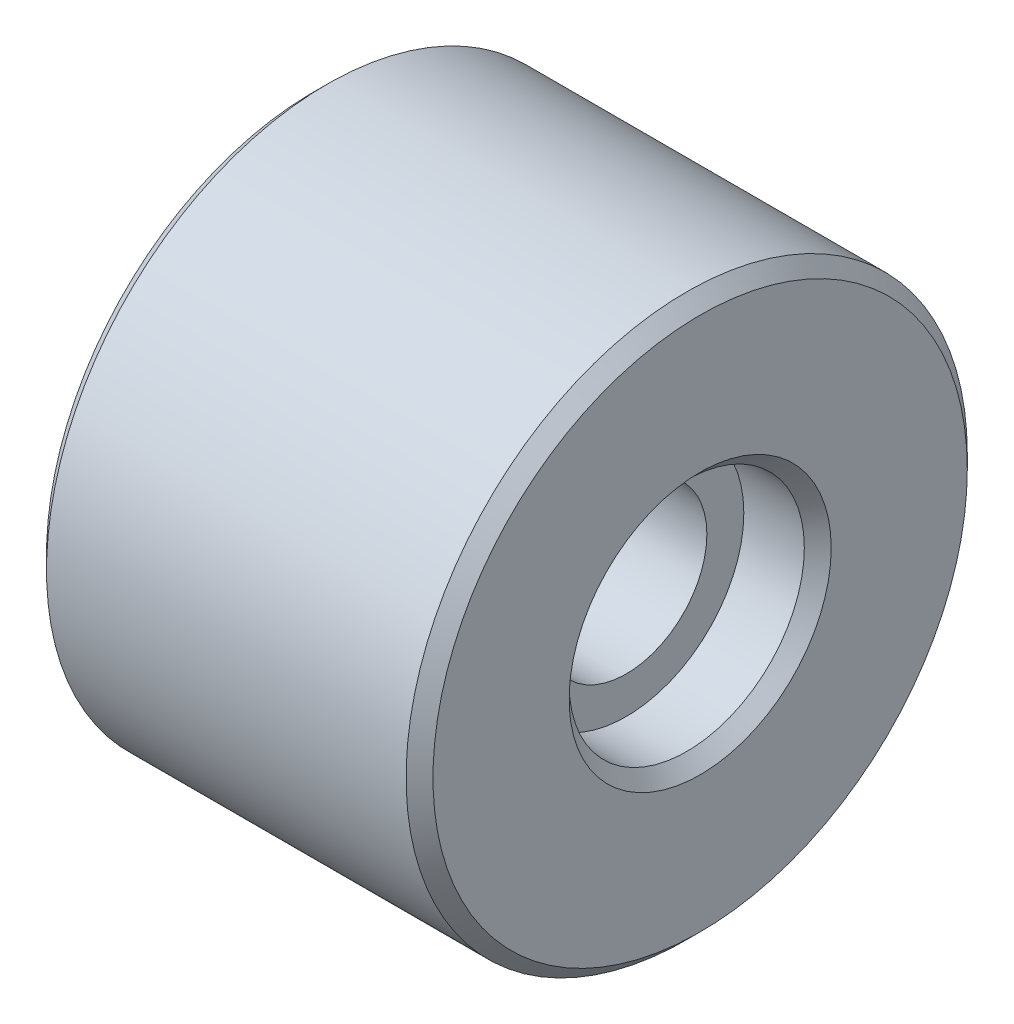
ISO-10303-21;
HEADER;
FILE_DESCRIPTION(('STEP AP214'),'2;1');
FILE_NAME('part.step','',(''),(''),'','','');
FILE_SCHEMA(('AUTOMOTIVE_DESIGN { 1 0 10303 214 1 1 1 1 }'));
ENDSEC;
DATA;
#1=APPLICATION_CONTEXT('core data for automotive mechanical design processes');
#2=APPLICATION_PROTOCOL_DEFINITION('international standard','automotive_design',2000,#1);
#3=PRODUCT_CONTEXT('',#1,'mechanical');
#4=PRODUCT('Part','Part','',(#3));
#5=PRODUCT_RELATED_PRODUCT_CATEGORY('part','',(#4));
#6=PRODUCT_DEFINITION_FORMATION('','',#4);
#7=PRODUCT_DEFINITION_CONTEXT('part definition',#1,'design');
#8=PRODUCT_DEFINITION('design','',#6,#7);
#9=PRODUCT_DEFINITION_SHAPE('','',#8);
#10=(LENGTH_UNIT() NAMED_UNIT(*) SI_UNIT(.MILLI.,.METRE.));
#11=(NAMED_UNIT(*) PLANE_ANGLE_UNIT() SI_UNIT($,.RADIAN.));
#12=(NAMED_UNIT(*) SI_UNIT($,.STERADIAN.) SOLID_ANGLE_UNIT());
#13=UNCERTAINTY_MEASURE_WITH_UNIT(LENGTH_MEASURE(1.E-05),#10,'distance_accuracy_value','');
#14=(GEOMETRIC_REPRESENTATION_CONTEXT(3) GLOBAL_UNCERTAINTY_ASSIGNED_CONTEXT((#13)) GLOBAL_UNIT_ASSIGNED_CONTEXT((#10,
#11,#12)) REPRESENTATION_CONTEXT('',''));
#15=CARTESIAN_POINT('',(0.,0.,0.));
#16=DIRECTION('',(0.,0.,1.));
#17=DIRECTION('',(1.,0.,0.));
#18=AXIS2_PLACEMENT_3D('',#15,#16,#17);
#19=CARTESIAN_POINT('',(11.5,0.,0.));
#20=DIRECTION('',(-1.,0.,0.));
#21=DIRECTION('',(0.,0.,1.));
#22=AXIS2_PLACEMENT_3D('',#19,#20,#21);
#23=CYLINDRICAL_SURFACE('',#22,2.4);
#24=CARTESIAN_POINT('',(0.400000000000005,0.,0.));
#25=DIRECTION('',(1.,0.,0.));
#26=DIRECTION('',(0.,0.,-1.));
#27=AXIS2_PLACEMENT_3D('',#24,#25,#26);
#28=CIRCLE('',#27,2.4);
#29=CARTESIAN_POINT('',(0.400000000000005,0.,-2.4));
#30=VERTEX_POINT('',#29);
#31=EDGE_CURVE('E55',#30,#30,#28,.F.);
#32=ORIENTED_EDGE('',*,*,#31,.T.);
#33=EDGE_LOOP('',(#32));
#34=FACE_BOUND('',#33,.T.);
#35=CARTESIAN_POINT('',(9.3,0.,0.));
#36=DIRECTION('',(1.,0.,0.));
#37=DIRECTION('',(0.,0.,-1.));
#38=AXIS2_PLACEMENT_3D('',#35,#36,#37);
#39=CIRCLE('',#38,2.4);
#40=CARTESIAN_POINT('',(9.3,0.,-2.4));
#41=VERTEX_POINT('',#40);
#42=EDGE_CURVE('E64',#41,#41,#39,.T.);
#43=ORIENTED_EDGE('',*,*,#42,.T.);
#44=EDGE_LOOP('',(#43));
#45=FACE_BOUND('',#44,.T.);
#46=ADVANCED_FACE('F32',(#34,#45),#23,.F.);
#47=CARTESIAN_POINT('',(11.5,0.,0.));
#48=DIRECTION('',(1.,0.,0.));
#49=DIRECTION('',(0.,0.,-1.));
#50=AXIS2_PLACEMENT_3D('',#47,#48,#49);
#51=PLANE('',#50);
#52=CARTESIAN_POINT('',(11.5,0.,0.));
#53=DIRECTION('',(1.,0.,0.));
#54=DIRECTION('',(0.,0.,-1.));
#55=AXIS2_PLACEMENT_3D('',#52,#53,#54);
#56=CIRCLE('',#55,3.9);
#57=CARTESIAN_POINT('',(11.5,0.,-3.9));
#58=VERTEX_POINT('',#57);
#59=EDGE_CURVE('E43',#58,#58,#56,.F.);
#60=ORIENTED_EDGE('',*,*,#59,.T.);
#61=EDGE_LOOP('',(#60));
#62=FACE_BOUND('',#61,.T.);
#63=CARTESIAN_POINT('',(11.5,0.,0.));
#64=DIRECTION('',(1.,0.,0.));
#65=DIRECTION('',(0.,0.,-1.));
#66=AXIS2_PLACEMENT_3D('',#63,#64,#65);
#67=CIRCLE('',#66,7.95000000000001);
#68=CARTESIAN_POINT('',(11.5,0.,-7.95000000000001));
#69=VERTEX_POINT('',#68);
#70=EDGE_CURVE('E47',#69,#69,#67,.T.);
#71=ORIENTED_EDGE('',*,*,#70,.T.);
#72=EDGE_LOOP('',(#71));
#73=FACE_BOUND('',#72,.T.);
#74=ADVANCED_FACE('F89',(#62,#73),#51,.T.);
#75=CARTESIAN_POINT('',(0.,0.,0.));
#76=DIRECTION('',(1.,0.,0.));
#77=DIRECTION('',(0.,0.,-1.));
#78=AXIS2_PLACEMENT_3D('',#75,#76,#77);
#79=PLANE('',#78);
#80=CARTESIAN_POINT('',(0.,0.,0.));
#81=DIRECTION('',(1.,0.,0.));
#82=DIRECTION('',(0.,0.,-1.));
#83=AXIS2_PLACEMENT_3D('',#80,#81,#82);
#84=CIRCLE('',#83,2.8);
#85=CARTESIAN_POINT('',(0.,0.,-2.8));
#86=VERTEX_POINT('',#85);
#87=EDGE_CURVE('E58',#86,#86,#84,.T.);
#88=ORIENTED_EDGE('',*,*,#87,.T.);
#89=EDGE_LOOP('',(#88));
#90=FACE_BOUND('',#89,.T.);
#91=CARTESIAN_POINT('',(0.,0.,0.));
#92=DIRECTION('',(1.,0.,0.));
#93=DIRECTION('',(0.,0.,-1.));
#94=AXIS2_PLACEMENT_3D('',#91,#92,#93);
#95=CIRCLE('',#94,7.95);
#96=CARTESIAN_POINT('',(0.,0.,-7.95));
#97=VERTEX_POINT('',#96);
#98=EDGE_CURVE('E61',#97,#97,#95,.F.);
#99=ORIENTED_EDGE('',*,*,#98,.T.);
#100=EDGE_LOOP('',(#99));
#101=FACE_BOUND('',#100,.T.);
#102=ADVANCED_FACE('F85',(#90,#101),#79,.F.);
#103=CARTESIAN_POINT('',(11.5,0.,0.));
#104=DIRECTION('',(-1.,0.,0.));
#105=DIRECTION('',(0.,0.,1.));
#106=AXIS2_PLACEMENT_3D('',#103,#104,#105);
#107=CYLINDRICAL_SURFACE('',#106,8.35);
#108=CARTESIAN_POINT('',(0.399999999999999,0.,0.));
#109=DIRECTION('',(1.,0.,0.));
#110=DIRECTION('',(0.,0.,-1.));
#111=AXIS2_PLACEMENT_3D('',#108,#109,#110);
#112=CIRCLE('',#111,8.35);
#113=CARTESIAN_POINT('',(0.399999999999999,0.,-8.35));
#114=VERTEX_POINT('',#113);
#115=EDGE_CURVE('E10',#114,#114,#112,.T.);
#116=ORIENTED_EDGE('',*,*,#115,.T.);
#117=EDGE_LOOP('',(#116));
#118=FACE_BOUND('',#117,.T.);
#119=CARTESIAN_POINT('',(11.1,0.,0.));
#120=DIRECTION('',(1.,0.,0.));
#121=DIRECTION('',(0.,0.,-1.));
#122=AXIS2_PLACEMENT_3D('',#119,#120,#121);
#123=CIRCLE('',#122,8.35);
#124=CARTESIAN_POINT('',(11.1,0.,-8.35));
#125=VERTEX_POINT('',#124);
#126=EDGE_CURVE('E39',#125,#125,#123,.F.);
#127=ORIENTED_EDGE('',*,*,#126,.T.);
#128=EDGE_LOOP('',(#127));
#129=FACE_BOUND('',#128,.T.);
#130=ADVANCED_FACE('F75',(#118,#129),#107,.T.);
#131=CARTESIAN_POINT('',(9.3,0.,0.));
#132=DIRECTION('',(1.,0.,0.));
#133=DIRECTION('',(0.,0.,-1.));
#134=AXIS2_PLACEMENT_3D('',#131,#132,#133);
#135=CYLINDRICAL_SURFACE('',#134,3.5);
#136=CARTESIAN_POINT('',(11.1,0.,0.));
#137=DIRECTION('',(1.,0.,0.));
#138=DIRECTION('',(0.,0.,-1.));
#139=AXIS2_PLACEMENT_3D('',#136,#137,#138);
#140=CIRCLE('',#139,3.5);
#141=CARTESIAN_POINT('',(11.1,0.,-3.5));
#142=VERTEX_POINT('',#141);
#143=EDGE_CURVE('E52',#142,#142,#140,.T.);
#144=ORIENTED_EDGE('',*,*,#143,.T.);
#145=EDGE_LOOP('',(#144));
#146=FACE_BOUND('',#145,.T.);
#147=CARTESIAN_POINT('',(9.3,0.,0.));
#148=DIRECTION('',(1.,0.,0.));
#149=DIRECTION('',(0.,0.,-1.));
#150=AXIS2_PLACEMENT_3D('',#147,#148,#149);
#151=CIRCLE('',#150,3.5);
#152=CARTESIAN_POINT('',(9.3,0.,-3.5));
#153=VERTEX_POINT('',#152);
#154=EDGE_CURVE('E67',#153,#153,#151,.T.);
#155=ORIENTED_EDGE('',*,*,#154,.F.);
#156=EDGE_LOOP('',(#155));
#157=FACE_BOUND('',#156,.T.);
#158=ADVANCED_FACE('F73',(#146,#157),#135,.F.);
#159=CARTESIAN_POINT('',(9.3,0.,0.));
#160=DIRECTION('',(1.,0.,0.));
#161=DIRECTION('',(0.,0.,-1.));
#162=AXIS2_PLACEMENT_3D('',#159,#160,#161);
#163=PLANE('',#162);
#164=ORIENTED_EDGE('',*,*,#42,.F.);
#165=EDGE_LOOP('',(#164));
#166=FACE_BOUND('',#165,.T.);
#167=ORIENTED_EDGE('',*,*,#154,.T.);
#168=EDGE_LOOP('',(#167));
#169=FACE_BOUND('',#168,.T.);
#170=ADVANCED_FACE('F71',(#166,#169),#163,.T.);
#171=CARTESIAN_POINT('',(0.,0.,0.));
#172=DIRECTION('',(-1.,0.,0.));
#173=DIRECTION('',(0.,0.,1.));
#174=AXIS2_PLACEMENT_3D('',#171,#172,#173);
#175=CONICAL_SURFACE('',#174,2.8,0.785398163397448);
#176=ORIENTED_EDGE('',*,*,#31,.F.);
#177=EDGE_LOOP('',(#176));
#178=FACE_BOUND('',#177,.T.);
#179=ORIENTED_EDGE('',*,*,#87,.F.);
#180=EDGE_LOOP('',(#179));
#181=FACE_BOUND('',#180,.T.);
#182=ADVANCED_FACE('F82',(#178,#181),#175,.F.);
#183=CARTESIAN_POINT('',(11.1,0.,0.));
#184=DIRECTION('',(1.,0.,0.));
#185=DIRECTION('',(0.,0.,-1.));
#186=AXIS2_PLACEMENT_3D('',#183,#184,#185);
#187=CONICAL_SURFACE('',#186,3.5,0.785398163397452);
#188=ORIENTED_EDGE('',*,*,#59,.F.);
#189=EDGE_LOOP('',(#188));
#190=FACE_BOUND('',#189,.T.);
#191=ORIENTED_EDGE('',*,*,#143,.F.);
#192=EDGE_LOOP('',(#191));
#193=FACE_BOUND('',#192,.T.);
#194=ADVANCED_FACE('F103',(#190,#193),#187,.F.);
#195=CARTESIAN_POINT('',(0.399999999999999,0.,0.));
#196=DIRECTION('',(1.,0.,0.));
#197=DIRECTION('',(0.,0.,-1.));
#198=AXIS2_PLACEMENT_3D('',#195,#196,#197);
#199=CONICAL_SURFACE('',#198,8.35,0.785398163397448);
#200=ORIENTED_EDGE('',*,*,#98,.F.);
#201=EDGE_LOOP('',(#200));
#202=FACE_BOUND('',#201,.T.);
#203=ORIENTED_EDGE('',*,*,#115,.F.);
#204=EDGE_LOOP('',(#203));
#205=FACE_BOUND('',#204,.T.);
#206=ADVANCED_FACE('F106',(#202,#205),#199,.T.);
#207=CARTESIAN_POINT('',(11.5,0.,0.));
#208=DIRECTION('',(-1.,0.,0.));
#209=DIRECTION('',(0.,0.,1.));
#210=AXIS2_PLACEMENT_3D('',#207,#208,#209);
#211=CONICAL_SURFACE('',#210,7.95000000000001,0.785398163397442);
#212=ORIENTED_EDGE('',*,*,#126,.F.);
#213=EDGE_LOOP('',(#212));
#214=FACE_BOUND('',#213,.T.);
#215=ORIENTED_EDGE('',*,*,#70,.F.);
#216=EDGE_LOOP('',(#215));
#217=FACE_BOUND('',#216,.T.);
#218=ADVANCED_FACE('F34',(#214,#217),#211,.T.);
#219=CLOSED_SHELL('',(#46,#74,#102,#130,#158,#170,#182,#194,#206,#218));
#220=MANIFOLD_SOLID_BREP('B2',#219);
#221=ADVANCED_BREP_SHAPE_REPRESENTATION('',(#18,#220),#14);
#222=SHAPE_DEFINITION_REPRESENTATION(#9,#221);
ENDSEC;
END-ISO-10303-21;
